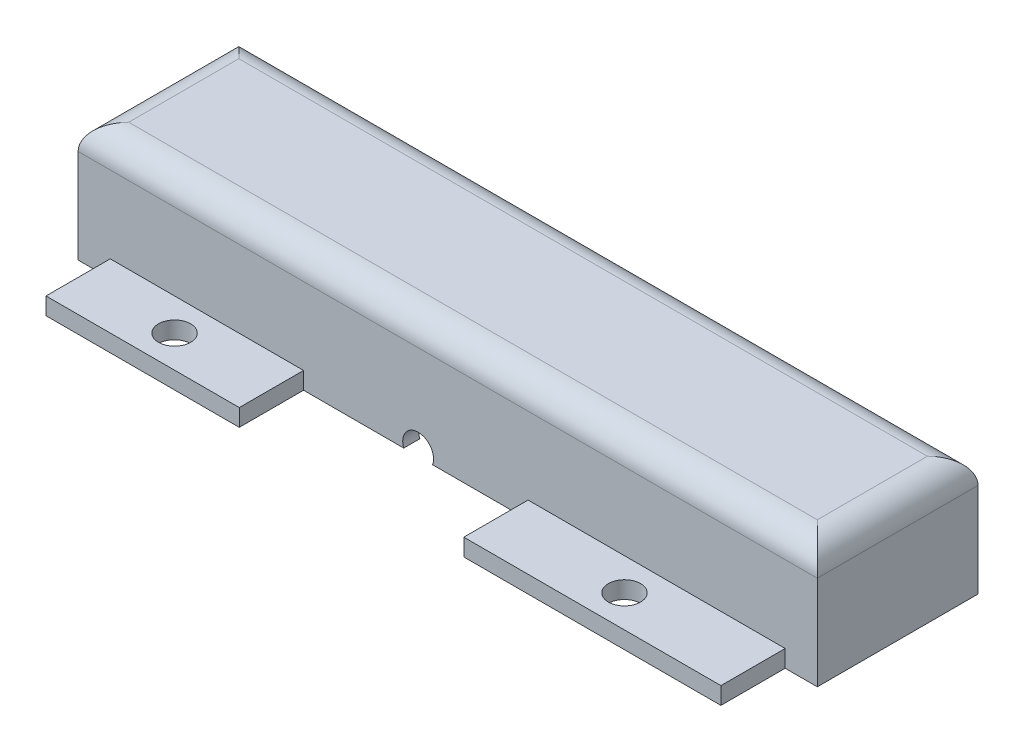
ISO-10303-21;
HEADER;
FILE_DESCRIPTION(('STEP AP214'),'2;1');
FILE_NAME('part.step','',(''),(''),'','','');
FILE_SCHEMA(('AUTOMOTIVE_DESIGN { 1 0 10303 214 1 1 1 1 }'));
ENDSEC;
DATA;
#1=APPLICATION_CONTEXT('core data for automotive mechanical design processes');
#2=APPLICATION_PROTOCOL_DEFINITION('international standard','automotive_design',2000,#1);
#3=PRODUCT_CONTEXT('',#1,'mechanical');
#4=PRODUCT('Part','Part','',(#3));
#5=PRODUCT_RELATED_PRODUCT_CATEGORY('part','',(#4));
#6=PRODUCT_DEFINITION_FORMATION('','',#4);
#7=PRODUCT_DEFINITION_CONTEXT('part definition',#1,'design');
#8=PRODUCT_DEFINITION('design','',#6,#7);
#9=PRODUCT_DEFINITION_SHAPE('','',#8);
#10=(LENGTH_UNIT() NAMED_UNIT(*) SI_UNIT(.MILLI.,.METRE.));
#11=(NAMED_UNIT(*) PLANE_ANGLE_UNIT() SI_UNIT($,.RADIAN.));
#12=(NAMED_UNIT(*) SI_UNIT($,.STERADIAN.) SOLID_ANGLE_UNIT());
#13=UNCERTAINTY_MEASURE_WITH_UNIT(LENGTH_MEASURE(1.E-05),#10,'distance_accuracy_value','');
#14=(GEOMETRIC_REPRESENTATION_CONTEXT(3) GLOBAL_UNCERTAINTY_ASSIGNED_CONTEXT((#13)) GLOBAL_UNIT_ASSIGNED_CONTEXT((#10,
#11,#12)) REPRESENTATION_CONTEXT('',''));
#15=CARTESIAN_POINT('',(0.,0.,0.));
#16=DIRECTION('',(0.,0.,1.));
#17=DIRECTION('',(1.,0.,0.));
#18=AXIS2_PLACEMENT_3D('',#15,#16,#17);
#19=CARTESIAN_POINT('',(0.,0.,0.));
#20=DIRECTION('',(0.,0.,-1.));
#21=DIRECTION('',(-1.,0.,0.));
#22=AXIS2_PLACEMENT_3D('',#19,#20,#21);
#23=PLANE('',#22);
#24=DIRECTION('',(1.,0.,0.));
#25=VECTOR('',#24,1.);
#26=CARTESIAN_POINT('',(-47.6209345794393,0.,0.));
#27=LINE('',#26,#25);
#28=CARTESIAN_POINT('',(38.4290654205607,0.,0.));
#29=VERTEX_POINT('',#28);
#30=CARTESIAN_POINT('',(98.4290654205607,0.,0.));
#31=VERTEX_POINT('',#30);
#32=EDGE_CURVE('E339',#29,#31,#27,.T.);
#33=ORIENTED_EDGE('',*,*,#32,.F.);
#34=DIRECTION('',(0.,-1.,0.));
#35=VECTOR('',#34,1.);
#36=CARTESIAN_POINT('',(38.4290654205607,3.39,0.));
#37=LINE('',#36,#35);
#38=CARTESIAN_POINT('',(38.4290654205607,3.39,0.));
#39=VERTEX_POINT('',#38);
#40=EDGE_CURVE('E217',#39,#29,#37,.T.);
#41=ORIENTED_EDGE('',*,*,#40,.F.);
#42=DIRECTION('',(1.,0.,0.));
#43=VECTOR('',#42,1.);
#44=CARTESIAN_POINT('',(38.4290654205607,3.39,0.));
#45=LINE('',#44,#43);
#46=CARTESIAN_POINT('',(13.0290654205607,3.39,0.));
#47=VERTEX_POINT('',#46);
#48=EDGE_CURVE('E213',#47,#39,#45,.T.);
#49=ORIENTED_EDGE('',*,*,#48,.F.);
#50=DIRECTION('',(0.,1.,0.));
#51=VECTOR('',#50,1.);
#52=CARTESIAN_POINT('',(13.0290654205607,3.39,0.));
#53=LINE('',#52,#51);
#54=CARTESIAN_POINT('',(13.0290654205607,0.,0.));
#55=VERTEX_POINT('',#54);
#56=EDGE_CURVE('E393',#55,#47,#53,.T.);
#57=ORIENTED_EDGE('',*,*,#56,.F.);
#58=CARTESIAN_POINT('',(-47.6209345794393,0.,0.));
#59=VERTEX_POINT('',#58);
#60=EDGE_CURVE('E340',#59,#55,#27,.T.);
#61=ORIENTED_EDGE('',*,*,#60,.F.);
#62=DIRECTION('',(0.,-1.,0.));
#63=VECTOR('',#62,1.);
#64=CARTESIAN_POINT('',(-47.6209345794393,0.,0.));
#65=LINE('',#64,#63);
#66=CARTESIAN_POINT('',(-47.6209345794393,18.59,0.));
#67=VERTEX_POINT('',#66);
#68=EDGE_CURVE('E318',#67,#59,#65,.T.);
#69=ORIENTED_EDGE('',*,*,#68,.F.);
#70=DIRECTION('',(-1.,0.,0.));
#71=VECTOR('',#70,1.);
#72=CARTESIAN_POINT('',(98.4290654205607,18.59,0.));
#73=LINE('',#72,#71);
#74=CARTESIAN_POINT('',(98.4290654205607,18.59,0.));
#75=VERTEX_POINT('',#74);
#76=EDGE_CURVE('E40',#67,#75,#73,.F.);
#77=ORIENTED_EDGE('',*,*,#76,.T.);
#78=DIRECTION('',(0.,1.,0.));
#79=VECTOR('',#78,1.);
#80=CARTESIAN_POINT('',(98.4290654205607,0.,0.));
#81=LINE('',#80,#79);
#82=EDGE_CURVE('E329',#31,#75,#81,.T.);
#83=ORIENTED_EDGE('',*,*,#82,.F.);
#84=EDGE_LOOP('',(#33,#41,#49,#57,#61,#69,#77,#83));
#85=FACE_BOUND('',#84,.T.);
#86=ADVANCED_FACE('F32',(#85),#23,.T.);
#87=CARTESIAN_POINT('',(0.,0.,31.75));
#88=DIRECTION('',(0.,0.,-1.));
#89=DIRECTION('',(-1.,0.,0.));
#90=AXIS2_PLACEMENT_3D('',#87,#88,#89);
#91=PLANE('',#90);
#92=DIRECTION('',(0.,-1.,0.));
#93=VECTOR('',#92,1.);
#94=CARTESIAN_POINT('',(41.2790654205607,0.,31.75));
#95=LINE('',#94,#93);
#96=CARTESIAN_POINT('',(41.2790654205607,3.39,31.75));
#97=VERTEX_POINT('',#96);
#98=CARTESIAN_POINT('',(41.2790654205607,0.,31.75));
#99=VERTEX_POINT('',#98);
#100=EDGE_CURVE('E55',#97,#99,#95,.T.);
#101=ORIENTED_EDGE('',*,*,#100,.F.);
#102=DIRECTION('',(-1.,0.,0.));
#103=VECTOR('',#102,1.);
#104=CARTESIAN_POINT('',(41.2790654205607,3.39,31.75));
#105=LINE('',#104,#103);
#106=CARTESIAN_POINT('',(92.0790654205607,3.39,31.75));
#107=VERTEX_POINT('',#106);
#108=EDGE_CURVE('E229',#107,#97,#105,.T.);
#109=ORIENTED_EDGE('',*,*,#108,.F.);
#110=DIRECTION('',(0.,1.,0.));
#111=VECTOR('',#110,1.);
#112=CARTESIAN_POINT('',(92.0790654205607,0.,31.75));
#113=LINE('',#112,#111);
#114=CARTESIAN_POINT('',(92.0790654205607,0.,31.75));
#115=VERTEX_POINT('',#114);
#116=EDGE_CURVE('E220',#115,#107,#113,.T.);
#117=ORIENTED_EDGE('',*,*,#116,.F.);
#118=DIRECTION('',(1.,0.,0.));
#119=VECTOR('',#118,1.);
#120=CARTESIAN_POINT('',(-47.6209345794393,0.,31.75));
#121=LINE('',#120,#119);
#122=CARTESIAN_POINT('',(98.4290654205607,0.,31.75));
#123=VERTEX_POINT('',#122);
#124=EDGE_CURVE('E328',#115,#123,#121,.T.);
#125=ORIENTED_EDGE('',*,*,#124,.T.);
#126=DIRECTION('',(0.,1.,0.));
#127=VECTOR('',#126,1.);
#128=CARTESIAN_POINT('',(98.4290654205607,0.,31.75));
#129=LINE('',#128,#127);
#130=CARTESIAN_POINT('',(98.4290654205607,18.59,31.75));
#131=VERTEX_POINT('',#130);
#132=EDGE_CURVE('E332',#123,#131,#129,.T.);
#133=ORIENTED_EDGE('',*,*,#132,.T.);
#134=DIRECTION('',(-1.,0.,0.));
#135=VECTOR('',#134,1.);
#136=CARTESIAN_POINT('',(0.,18.59,31.75));
#137=LINE('',#136,#135);
#138=CARTESIAN_POINT('',(-47.6209345794393,18.59,31.75));
#139=VERTEX_POINT('',#138);
#140=EDGE_CURVE('E361',#131,#139,#137,.T.);
#141=ORIENTED_EDGE('',*,*,#140,.T.);
#142=DIRECTION('',(0.,-1.,0.));
#143=VECTOR('',#142,1.);
#144=CARTESIAN_POINT('',(-47.6209345794393,0.,31.75));
#145=LINE('',#144,#143);
#146=CARTESIAN_POINT('',(-47.6209345794393,0.,31.75));
#147=VERTEX_POINT('',#146);
#148=EDGE_CURVE('E326',#139,#147,#145,.T.);
#149=ORIENTED_EDGE('',*,*,#148,.T.);
#150=CARTESIAN_POINT('',(-41.2709345794393,0.,31.75));
#151=VERTEX_POINT('',#150);
#152=EDGE_CURVE('E330',#147,#151,#121,.T.);
#153=ORIENTED_EDGE('',*,*,#152,.T.);
#154=DIRECTION('',(0.,-1.,0.));
#155=VECTOR('',#154,1.);
#156=CARTESIAN_POINT('',(-41.2709345794393,0.,31.75));
#157=LINE('',#156,#155);
#158=CARTESIAN_POINT('',(-41.2709345794393,3.39,31.75));
#159=VERTEX_POINT('',#158);
#160=EDGE_CURVE('E250',#159,#151,#157,.T.);
#161=ORIENTED_EDGE('',*,*,#160,.F.);
#162=DIRECTION('',(-1.,0.,0.));
#163=VECTOR('',#162,1.);
#164=CARTESIAN_POINT('',(-41.2709345794393,3.39,31.75));
#165=LINE('',#164,#163);
#166=CARTESIAN_POINT('',(-3.08093457943929,3.39,31.75));
#167=VERTEX_POINT('',#166);
#168=EDGE_CURVE('E255',#167,#159,#165,.T.);
#169=ORIENTED_EDGE('',*,*,#168,.F.);
#170=DIRECTION('',(0.,1.,0.));
#171=VECTOR('',#170,1.);
#172=CARTESIAN_POINT('',(-3.08093457943929,0.,31.75));
#173=LINE('',#172,#171);
#174=CARTESIAN_POINT('',(-3.08093457943929,0.,31.75));
#175=VERTEX_POINT('',#174);
#176=EDGE_CURVE('E264',#175,#167,#173,.T.);
#177=ORIENTED_EDGE('',*,*,#176,.F.);
#178=CARTESIAN_POINT('',(16.7104868276481,0.,31.75));
#179=VERTEX_POINT('',#178);
#180=EDGE_CURVE('E333',#175,#179,#121,.T.);
#181=ORIENTED_EDGE('',*,*,#180,.T.);
#182=CARTESIAN_POINT('',(19.5590654205607,1.09,31.75));
#183=DIRECTION('',(0.,0.,1.));
#184=DIRECTION('',(1.,0.,0.));
#185=AXIS2_PLACEMENT_3D('',#182,#183,#184);
#186=CIRCLE('',#185,3.05);
#187=CARTESIAN_POINT('',(22.4076440134733,0.,31.75));
#188=VERTEX_POINT('',#187);
#189=EDGE_CURVE('E280',#188,#179,#186,.T.);
#190=ORIENTED_EDGE('',*,*,#189,.F.);
#191=EDGE_CURVE('E334',#188,#99,#121,.T.);
#192=ORIENTED_EDGE('',*,*,#191,.T.);
#193=EDGE_LOOP('',(#101,#109,#117,#125,#133,#141,#149,#153,#161,#169,#177,#181,#190,#192));
#194=FACE_BOUND('',#193,.T.);
#195=ADVANCED_FACE('F396',(#194),#91,.F.);
#196=CARTESIAN_POINT('',(-47.6209345794393,0.,31.75));
#197=DIRECTION('',(1.,0.,0.));
#198=DIRECTION('',(0.,0.,-1.));
#199=AXIS2_PLACEMENT_3D('',#196,#197,#198);
#200=PLANE('',#199);
#201=ORIENTED_EDGE('',*,*,#148,.F.);
#202=DIRECTION('',(0.,0.,-1.));
#203=VECTOR('',#202,1.);
#204=CARTESIAN_POINT('',(-47.6209345794393,18.59,31.75));
#205=LINE('',#204,#203);
#206=EDGE_CURVE('E363',#139,#67,#205,.T.);
#207=ORIENTED_EDGE('',*,*,#206,.T.);
#208=ORIENTED_EDGE('',*,*,#68,.T.);
#209=DIRECTION('',(0.,0.,-1.));
#210=VECTOR('',#209,1.);
#211=CARTESIAN_POINT('',(-47.6209345794393,0.,31.75));
#212=LINE('',#211,#210);
#213=EDGE_CURVE('E346',#147,#59,#212,.T.);
#214=ORIENTED_EDGE('',*,*,#213,.F.);
#215=EDGE_LOOP('',(#201,#207,#208,#214));
#216=FACE_BOUND('',#215,.T.);
#217=ADVANCED_FACE('F386',(#216),#200,.F.);
#218=CARTESIAN_POINT('',(-47.6209345794393,0.,31.75));
#219=DIRECTION('',(0.,1.,0.));
#220=DIRECTION('',(0.,0.,1.));
#221=AXIS2_PLACEMENT_3D('',#218,#219,#220);
#222=PLANE('',#221);
#223=CARTESIAN_POINT('',(25.7290654205607,0.,-6.35));
#224=DIRECTION('',(0.,1.,0.));
#225=DIRECTION('',(0.,0.,1.));
#226=AXIS2_PLACEMENT_3D('',#223,#224,#225);
#227=CIRCLE('',#226,3.175);
#228=CARTESIAN_POINT('',(25.7290654205607,0.,-3.175));
#229=VERTEX_POINT('',#228);
#230=EDGE_CURVE('E512',#229,#229,#227,.T.);
#231=ORIENTED_EDGE('',*,*,#230,.T.);
#232=EDGE_LOOP('',(#231));
#233=FACE_BOUND('',#232,.T.);
#234=CARTESIAN_POINT('',(-22.2209345794393,0.,38.1));
#235=DIRECTION('',(0.,1.,0.));
#236=DIRECTION('',(0.,0.,1.));
#237=AXIS2_PLACEMENT_3D('',#234,#235,#236);
#238=CIRCLE('',#237,3.175);
#239=CARTESIAN_POINT('',(-22.2209345794393,0.,41.275));
#240=VERTEX_POINT('',#239);
#241=EDGE_CURVE('E526',#240,#240,#238,.T.);
#242=ORIENTED_EDGE('',*,*,#241,.T.);
#243=EDGE_LOOP('',(#242));
#244=FACE_BOUND('',#243,.T.);
#245=CARTESIAN_POINT('',(66.6790654205607,0.,38.1));
#246=DIRECTION('',(0.,1.,0.));
#247=DIRECTION('',(0.,0.,1.));
#248=AXIS2_PLACEMENT_3D('',#245,#246,#247);
#249=CIRCLE('',#248,3.175);
#250=CARTESIAN_POINT('',(66.6790654205607,0.,41.275));
#251=VERTEX_POINT('',#250);
#252=EDGE_CURVE('E522',#251,#251,#249,.T.);
#253=ORIENTED_EDGE('',*,*,#252,.T.);
#254=EDGE_LOOP('',(#253));
#255=FACE_BOUND('',#254,.T.);
#256=DIRECTION('',(-1.,0.,0.));
#257=VECTOR('',#256,1.);
#258=CARTESIAN_POINT('',(95.2490654205607,0.,28.57));
#259=LINE('',#258,#257);
#260=CARTESIAN_POINT('',(16.7104868276481,0.,28.57));
#261=VERTEX_POINT('',#260);
#262=CARTESIAN_POINT('',(-44.4409345794393,0.,28.57));
#263=VERTEX_POINT('',#262);
#264=EDGE_CURVE('E310',#261,#263,#259,.T.);
#265=ORIENTED_EDGE('',*,*,#264,.F.);
#266=DIRECTION('',(0.,0.,1.));
#267=VECTOR('',#266,1.);
#268=CARTESIAN_POINT('',(16.7104868276481,0.,28.57));
#269=LINE('',#268,#267);
#270=EDGE_CURVE('E286',#261,#179,#269,.T.);
#271=ORIENTED_EDGE('',*,*,#270,.T.);
#272=ORIENTED_EDGE('',*,*,#180,.F.);
#273=DIRECTION('',(0.,0.,-1.));
#274=VECTOR('',#273,1.);
#275=CARTESIAN_POINT('',(-3.08093457943929,0.,44.45));
#276=LINE('',#275,#274);
#277=CARTESIAN_POINT('',(-3.08093457943929,0.,44.45));
#278=VERTEX_POINT('',#277);
#279=EDGE_CURVE('E274',#278,#175,#276,.T.);
#280=ORIENTED_EDGE('',*,*,#279,.F.);
#281=DIRECTION('',(1.,0.,0.));
#282=VECTOR('',#281,1.);
#283=CARTESIAN_POINT('',(-41.2709345794393,0.,44.45));
#284=LINE('',#283,#282);
#285=CARTESIAN_POINT('',(-41.2709345794393,0.,44.45));
#286=VERTEX_POINT('',#285);
#287=EDGE_CURVE('E254',#286,#278,#284,.T.);
#288=ORIENTED_EDGE('',*,*,#287,.F.);
#289=DIRECTION('',(0.,0.,-1.));
#290=VECTOR('',#289,1.);
#291=CARTESIAN_POINT('',(-41.2709345794393,0.,44.45));
#292=LINE('',#291,#290);
#293=EDGE_CURVE('E277',#286,#151,#292,.T.);
#294=ORIENTED_EDGE('',*,*,#293,.T.);
#295=ORIENTED_EDGE('',*,*,#152,.F.);
#296=ORIENTED_EDGE('',*,*,#213,.T.);
#297=ORIENTED_EDGE('',*,*,#60,.T.);
#298=DIRECTION('',(0.,0.,1.));
#299=VECTOR('',#298,1.);
#300=CARTESIAN_POINT('',(13.0290654205607,0.,-12.7));
#301=LINE('',#300,#299);
#302=CARTESIAN_POINT('',(13.0290654205607,0.,-12.7));
#303=VERTEX_POINT('',#302);
#304=EDGE_CURVE('E201',#303,#55,#301,.T.);
#305=ORIENTED_EDGE('',*,*,#304,.F.);
#306=DIRECTION('',(-1.,0.,0.));
#307=VECTOR('',#306,1.);
#308=CARTESIAN_POINT('',(38.4290654205607,0.,-12.7));
#309=LINE('',#308,#307);
#310=CARTESIAN_POINT('',(38.4290654205607,0.,-12.7));
#311=VERTEX_POINT('',#310);
#312=EDGE_CURVE('E193',#311,#303,#309,.T.);
#313=ORIENTED_EDGE('',*,*,#312,.F.);
#314=DIRECTION('',(0.,0.,1.));
#315=VECTOR('',#314,1.);
#316=CARTESIAN_POINT('',(38.4290654205607,0.,-12.7));
#317=LINE('',#316,#315);
#318=EDGE_CURVE('E198',#311,#29,#317,.T.);
#319=ORIENTED_EDGE('',*,*,#318,.T.);
#320=ORIENTED_EDGE('',*,*,#32,.T.);
#321=DIRECTION('',(0.,0.,-1.));
#322=VECTOR('',#321,1.);
#323=CARTESIAN_POINT('',(98.4290654205607,0.,31.75));
#324=LINE('',#323,#322);
#325=EDGE_CURVE('E337',#123,#31,#324,.T.);
#326=ORIENTED_EDGE('',*,*,#325,.F.);
#327=ORIENTED_EDGE('',*,*,#124,.F.);
#328=DIRECTION('',(0.,0.,-1.));
#329=VECTOR('',#328,1.);
#330=CARTESIAN_POINT('',(92.0790654205607,0.,44.45));
#331=LINE('',#330,#329);
#332=CARTESIAN_POINT('',(92.0790654205607,0.,44.45));
#333=VERTEX_POINT('',#332);
#334=EDGE_CURVE('E244',#333,#115,#331,.T.);
#335=ORIENTED_EDGE('',*,*,#334,.F.);
#336=DIRECTION('',(1.,0.,0.));
#337=VECTOR('',#336,1.);
#338=CARTESIAN_POINT('',(41.2790654205607,0.,44.45));
#339=LINE('',#338,#337);
#340=CARTESIAN_POINT('',(41.2790654205607,0.,44.45));
#341=VERTEX_POINT('',#340);
#342=EDGE_CURVE('E228',#341,#333,#339,.T.);
#343=ORIENTED_EDGE('',*,*,#342,.F.);
#344=DIRECTION('',(0.,0.,-1.));
#345=VECTOR('',#344,1.);
#346=CARTESIAN_POINT('',(41.2790654205607,0.,44.45));
#347=LINE('',#346,#345);
#348=EDGE_CURVE('E247',#341,#99,#347,.T.);
#349=ORIENTED_EDGE('',*,*,#348,.T.);
#350=ORIENTED_EDGE('',*,*,#191,.F.);
#351=DIRECTION('',(0.,0.,1.));
#352=VECTOR('',#351,1.);
#353=CARTESIAN_POINT('',(22.4076440134733,0.,28.57));
#354=LINE('',#353,#352);
#355=CARTESIAN_POINT('',(22.4076440134733,0.,28.57));
#356=VERTEX_POINT('',#355);
#357=EDGE_CURVE('E283',#188,#356,#354,.F.);
#358=ORIENTED_EDGE('',*,*,#357,.T.);
#359=CARTESIAN_POINT('',(95.2490654205607,0.,28.57));
#360=VERTEX_POINT('',#359);
#361=EDGE_CURVE('E311',#360,#356,#259,.T.);
#362=ORIENTED_EDGE('',*,*,#361,.F.);
#363=DIRECTION('',(0.,0.,1.));
#364=VECTOR('',#363,1.);
#365=CARTESIAN_POINT('',(95.2490654205607,0.,3.18));
#366=LINE('',#365,#364);
#367=CARTESIAN_POINT('',(95.2490654205607,0.,3.18));
#368=VERTEX_POINT('',#367);
#369=EDGE_CURVE('E306',#368,#360,#366,.T.);
#370=ORIENTED_EDGE('',*,*,#369,.F.);
#371=DIRECTION('',(1.,0.,0.));
#372=VECTOR('',#371,1.);
#373=CARTESIAN_POINT('',(-44.4409345794393,0.,3.18));
#374=LINE('',#373,#372);
#375=CARTESIAN_POINT('',(-44.4409345794393,0.,3.18));
#376=VERTEX_POINT('',#375);
#377=EDGE_CURVE('E304',#376,#368,#374,.T.);
#378=ORIENTED_EDGE('',*,*,#377,.F.);
#379=DIRECTION('',(0.,0.,-1.));
#380=VECTOR('',#379,1.);
#381=CARTESIAN_POINT('',(-44.4409345794393,0.,28.57));
#382=LINE('',#381,#380);
#383=EDGE_CURVE('E294',#263,#376,#382,.T.);
#384=ORIENTED_EDGE('',*,*,#383,.F.);
#385=EDGE_LOOP('',(#265,#271,#272,#280,#288,#294,#295,#296,#297,#305,#313,#319,#320,#326,#327,
#335,#343,#349,#350,#358,#362,#370,#378,#384));
#386=FACE_BOUND('',#385,.T.);
#387=ADVANCED_FACE('F196',(#233,#244,#255,#386),#222,.F.);
#388=CARTESIAN_POINT('',(98.4290654205607,0.,31.75));
#389=DIRECTION('',(-1.,0.,0.));
#390=DIRECTION('',(0.,0.,1.));
#391=AXIS2_PLACEMENT_3D('',#388,#389,#390);
#392=PLANE('',#391);
#393=ORIENTED_EDGE('',*,*,#82,.T.);
#394=DIRECTION('',(0.,0.,-1.));
#395=VECTOR('',#394,1.);
#396=CARTESIAN_POINT('',(98.4290654205607,18.59,31.75));
#397=LINE('',#396,#395);
#398=EDGE_CURVE('E358',#75,#131,#397,.F.);
#399=ORIENTED_EDGE('',*,*,#398,.T.);
#400=ORIENTED_EDGE('',*,*,#132,.F.);
#401=ORIENTED_EDGE('',*,*,#325,.T.);
#402=EDGE_LOOP('',(#393,#399,#400,#401));
#403=FACE_BOUND('',#402,.T.);
#404=ADVANCED_FACE('F401',(#403),#392,.F.);
#405=CARTESIAN_POINT('',(-47.6209345794393,23.59,31.75));
#406=DIRECTION('',(0.,-1.,0.));
#407=DIRECTION('',(0.,0.,-1.));
#408=AXIS2_PLACEMENT_3D('',#405,#406,#407);
#409=PLANE('',#408);
#410=DIRECTION('',(-1.,0.,0.));
#411=VECTOR('',#410,1.);
#412=CARTESIAN_POINT('',(-47.6209345794393,23.59,26.75));
#413=LINE('',#412,#411);
#414=CARTESIAN_POINT('',(-42.6209345794393,23.59,26.75));
#415=VERTEX_POINT('',#414);
#416=CARTESIAN_POINT('',(93.4290654205607,23.59,26.75));
#417=VERTEX_POINT('',#416);
#418=EDGE_CURVE('E353',#415,#417,#413,.F.);
#419=ORIENTED_EDGE('',*,*,#418,.T.);
#420=DIRECTION('',(0.,0.,-1.));
#421=VECTOR('',#420,1.);
#422=CARTESIAN_POINT('',(93.4290654205607,23.59,31.75));
#423=LINE('',#422,#421);
#424=CARTESIAN_POINT('',(93.4290654205607,23.59,5.));
#425=VERTEX_POINT('',#424);
#426=EDGE_CURVE('E355',#417,#425,#423,.T.);
#427=ORIENTED_EDGE('',*,*,#426,.T.);
#428=DIRECTION('',(-1.,0.,0.));
#429=VECTOR('',#428,1.);
#430=CARTESIAN_POINT('',(-47.6209345794393,23.59,5.));
#431=LINE('',#430,#429);
#432=CARTESIAN_POINT('',(-42.6209345794393,23.59,5.));
#433=VERTEX_POINT('',#432);
#434=EDGE_CURVE('E349',#425,#433,#431,.T.);
#435=ORIENTED_EDGE('',*,*,#434,.T.);
#436=DIRECTION('',(0.,0.,-1.));
#437=VECTOR('',#436,1.);
#438=CARTESIAN_POINT('',(-42.6209345794393,23.59,31.75));
#439=LINE('',#438,#437);
#440=EDGE_CURVE('E351',#433,#415,#439,.F.);
#441=ORIENTED_EDGE('',*,*,#440,.T.);
#442=EDGE_LOOP('',(#419,#427,#435,#441));
#443=FACE_BOUND('',#442,.T.);
#444=ADVANCED_FACE('F411',(#443),#409,.F.);
#445=CARTESIAN_POINT('',(-44.4409345794393,21.,3.18));
#446=DIRECTION('',(0.,0.,-1.));
#447=DIRECTION('',(-1.,0.,0.));
#448=AXIS2_PLACEMENT_3D('',#445,#446,#447);
#449=PLANE('',#448);
#450=ORIENTED_EDGE('',*,*,#377,.T.);
#451=DIRECTION('',(0.,-1.,0.));
#452=VECTOR('',#451,1.);
#453=CARTESIAN_POINT('',(95.2490654205607,21.,3.18));
#454=LINE('',#453,#452);
#455=CARTESIAN_POINT('',(95.2490654205607,21.,3.18));
#456=VERTEX_POINT('',#455);
#457=EDGE_CURVE('E303',#456,#368,#454,.T.);
#458=ORIENTED_EDGE('',*,*,#457,.F.);
#459=DIRECTION('',(1.,0.,0.));
#460=VECTOR('',#459,1.);
#461=CARTESIAN_POINT('',(-44.4409345794393,21.,3.18));
#462=LINE('',#461,#460);
#463=CARTESIAN_POINT('',(-44.4409345794393,21.,3.18));
#464=VERTEX_POINT('',#463);
#465=EDGE_CURVE('E290',#464,#456,#462,.T.);
#466=ORIENTED_EDGE('',*,*,#465,.F.);
#467=DIRECTION('',(0.,-1.,0.));
#468=VECTOR('',#467,1.);
#469=CARTESIAN_POINT('',(-44.4409345794393,21.,3.18));
#470=LINE('',#469,#468);
#471=EDGE_CURVE('E316',#464,#376,#470,.T.);
#472=ORIENTED_EDGE('',*,*,#471,.T.);
#473=EDGE_LOOP('',(#450,#458,#466,#472));
#474=FACE_BOUND('',#473,.T.);
#475=ADVANCED_FACE('F413',(#474),#449,.F.);
#476=CARTESIAN_POINT('',(-44.4409345794393,21.,28.57));
#477=DIRECTION('',(-1.,0.,0.));
#478=DIRECTION('',(0.,0.,1.));
#479=AXIS2_PLACEMENT_3D('',#476,#477,#478);
#480=PLANE('',#479);
#481=ORIENTED_EDGE('',*,*,#383,.T.);
#482=ORIENTED_EDGE('',*,*,#471,.F.);
#483=DIRECTION('',(0.,0.,-1.));
#484=VECTOR('',#483,1.);
#485=CARTESIAN_POINT('',(-44.4409345794393,21.,28.57));
#486=LINE('',#485,#484);
#487=CARTESIAN_POINT('',(-44.4409345794393,21.,28.57));
#488=VERTEX_POINT('',#487);
#489=EDGE_CURVE('E300',#488,#464,#486,.T.);
#490=ORIENTED_EDGE('',*,*,#489,.F.);
#491=DIRECTION('',(0.,-1.,0.));
#492=VECTOR('',#491,1.);
#493=CARTESIAN_POINT('',(-44.4409345794393,21.,28.57));
#494=LINE('',#493,#492);
#495=EDGE_CURVE('E319',#488,#263,#494,.T.);
#496=ORIENTED_EDGE('',*,*,#495,.T.);
#497=EDGE_LOOP('',(#481,#482,#490,#496));
#498=FACE_BOUND('',#497,.T.);
#499=ADVANCED_FACE('F419',(#498),#480,.F.);
#500=CARTESIAN_POINT('',(95.2490654205607,21.,28.57));
#501=DIRECTION('',(0.,0.,1.));
#502=DIRECTION('',(1.,0.,0.));
#503=AXIS2_PLACEMENT_3D('',#500,#501,#502);
#504=PLANE('',#503);
#505=ORIENTED_EDGE('',*,*,#361,.T.);
#506=CARTESIAN_POINT('',(19.5590654205607,1.09,28.57));
#507=DIRECTION('',(0.,0.,1.));
#508=DIRECTION('',(1.,0.,0.));
#509=AXIS2_PLACEMENT_3D('',#506,#507,#508);
#510=CIRCLE('',#509,3.05);
#511=EDGE_CURVE('E11',#356,#261,#510,.T.);
#512=ORIENTED_EDGE('',*,*,#511,.T.);
#513=ORIENTED_EDGE('',*,*,#264,.T.);
#514=ORIENTED_EDGE('',*,*,#495,.F.);
#515=DIRECTION('',(-1.,0.,0.));
#516=VECTOR('',#515,1.);
#517=CARTESIAN_POINT('',(95.2490654205607,21.,28.57));
#518=LINE('',#517,#516);
#519=CARTESIAN_POINT('',(95.2490654205607,21.,28.57));
#520=VERTEX_POINT('',#519);
#521=EDGE_CURVE('E297',#520,#488,#518,.T.);
#522=ORIENTED_EDGE('',*,*,#521,.F.);
#523=DIRECTION('',(0.,-1.,0.));
#524=VECTOR('',#523,1.);
#525=CARTESIAN_POINT('',(95.2490654205607,21.,28.57));
#526=LINE('',#525,#524);
#527=EDGE_CURVE('E322',#520,#360,#526,.T.);
#528=ORIENTED_EDGE('',*,*,#527,.T.);
#529=EDGE_LOOP('',(#505,#512,#513,#514,#522,#528));
#530=FACE_BOUND('',#529,.T.);
#531=ADVANCED_FACE('F434',(#530),#504,.F.);
#532=CARTESIAN_POINT('',(95.2490654205607,21.,3.18));
#533=DIRECTION('',(1.,0.,0.));
#534=DIRECTION('',(0.,0.,-1.));
#535=AXIS2_PLACEMENT_3D('',#532,#533,#534);
#536=PLANE('',#535);
#537=ORIENTED_EDGE('',*,*,#369,.T.);
#538=ORIENTED_EDGE('',*,*,#527,.F.);
#539=DIRECTION('',(0.,0.,1.));
#540=VECTOR('',#539,1.);
#541=CARTESIAN_POINT('',(95.2490654205607,21.,3.18));
#542=LINE('',#541,#540);
#543=EDGE_CURVE('E293',#456,#520,#542,.T.);
#544=ORIENTED_EDGE('',*,*,#543,.F.);
#545=ORIENTED_EDGE('',*,*,#457,.T.);
#546=EDGE_LOOP('',(#537,#538,#544,#545));
#547=FACE_BOUND('',#546,.T.);
#548=ADVANCED_FACE('F430',(#547),#536,.F.);
#549=CARTESIAN_POINT('',(0.,21.,0.));
#550=DIRECTION('',(0.,-1.,0.));
#551=DIRECTION('',(0.,0.,-1.));
#552=AXIS2_PLACEMENT_3D('',#549,#550,#551);
#553=PLANE('',#552);
#554=ORIENTED_EDGE('',*,*,#465,.T.);
#555=ORIENTED_EDGE('',*,*,#543,.T.);
#556=ORIENTED_EDGE('',*,*,#521,.T.);
#557=ORIENTED_EDGE('',*,*,#489,.T.);
#558=EDGE_LOOP('',(#554,#555,#556,#557));
#559=FACE_BOUND('',#558,.T.);
#560=ADVANCED_FACE('F433',(#559),#553,.T.);
#561=CARTESIAN_POINT('',(-42.6209345794393,18.59,31.75));
#562=DIRECTION('',(0.,0.,-1.));
#563=DIRECTION('',(-1.,0.,0.));
#564=AXIS2_PLACEMENT_3D('',#561,#562,#563);
#565=CYLINDRICAL_SURFACE('',#564,5.);
#566=CARTESIAN_POINT('',(-42.6209345794393,18.59,5.));
#567=DIRECTION('',(0.707106781186547,0.,-0.707106781186547));
#568=DIRECTION('',(0.707106781186547,0.,0.707106781186547));
#569=AXIS2_PLACEMENT_3D('',#566,#567,#568);
#570=ELLIPSE('',#569,7.07106781186547,5.);
#571=EDGE_CURVE('E369',#67,#433,#570,.T.);
#572=ORIENTED_EDGE('',*,*,#571,.F.);
#573=ORIENTED_EDGE('',*,*,#206,.F.);
#574=CARTESIAN_POINT('',(-42.6209345794393,18.59,26.75));
#575=DIRECTION('',(-0.707106781186547,0.,-0.707106781186547));
#576=DIRECTION('',(0.707106781186547,0.,-0.707106781186547));
#577=AXIS2_PLACEMENT_3D('',#574,#575,#576);
#578=ELLIPSE('',#577,7.07106781186547,5.);
#579=EDGE_CURVE('E307',#415,#139,#578,.F.);
#580=ORIENTED_EDGE('',*,*,#579,.F.);
#581=ORIENTED_EDGE('',*,*,#440,.F.);
#582=EDGE_LOOP('',(#572,#573,#580,#581));
#583=FACE_BOUND('',#582,.T.);
#584=ADVANCED_FACE('F34',(#583),#565,.T.);
#585=CARTESIAN_POINT('',(0.,18.59,26.75));
#586=DIRECTION('',(-1.,0.,0.));
#587=DIRECTION('',(0.,0.,1.));
#588=AXIS2_PLACEMENT_3D('',#585,#586,#587);
#589=CYLINDRICAL_SURFACE('',#588,5.);
#590=ORIENTED_EDGE('',*,*,#579,.T.);
#591=ORIENTED_EDGE('',*,*,#140,.F.);
#592=CARTESIAN_POINT('',(93.4290654205607,18.59,26.75));
#593=DIRECTION('',(-0.707106781186547,0.,0.707106781186547));
#594=DIRECTION('',(-0.707106781186547,0.,-0.707106781186547));
#595=AXIS2_PLACEMENT_3D('',#592,#593,#594);
#596=ELLIPSE('',#595,7.07106781186547,5.);
#597=EDGE_CURVE('E367',#417,#131,#596,.F.);
#598=ORIENTED_EDGE('',*,*,#597,.F.);
#599=ORIENTED_EDGE('',*,*,#418,.F.);
#600=EDGE_LOOP('',(#590,#591,#598,#599));
#601=FACE_BOUND('',#600,.T.);
#602=ADVANCED_FACE('F376',(#601),#589,.T.);
#603=CARTESIAN_POINT('',(-47.6209345794393,18.59,5.));
#604=DIRECTION('',(1.,0.,0.));
#605=DIRECTION('',(0.,0.,-1.));
#606=AXIS2_PLACEMENT_3D('',#603,#604,#605);
#607=CYLINDRICAL_SURFACE('',#606,5.);
#608=ORIENTED_EDGE('',*,*,#571,.T.);
#609=ORIENTED_EDGE('',*,*,#434,.F.);
#610=CARTESIAN_POINT('',(93.4290654205607,18.59,5.));
#611=DIRECTION('',(0.707106781186547,0.,0.707106781186547));
#612=DIRECTION('',(0.707106781186547,0.,-0.707106781186547));
#613=AXIS2_PLACEMENT_3D('',#610,#611,#612);
#614=ELLIPSE('',#613,7.07106781186547,5.);
#615=EDGE_CURVE('E289',#75,#425,#614,.T.);
#616=ORIENTED_EDGE('',*,*,#615,.F.);
#617=ORIENTED_EDGE('',*,*,#76,.F.);
#618=EDGE_LOOP('',(#608,#609,#616,#617));
#619=FACE_BOUND('',#618,.T.);
#620=ADVANCED_FACE('F409',(#619),#607,.T.);
#621=CARTESIAN_POINT('',(93.4290654205607,18.59,31.75));
#622=DIRECTION('',(0.,0.,-1.));
#623=DIRECTION('',(-1.,0.,0.));
#624=AXIS2_PLACEMENT_3D('',#621,#622,#623);
#625=CYLINDRICAL_SURFACE('',#624,5.);
#626=ORIENTED_EDGE('',*,*,#597,.T.);
#627=ORIENTED_EDGE('',*,*,#398,.F.);
#628=ORIENTED_EDGE('',*,*,#615,.T.);
#629=ORIENTED_EDGE('',*,*,#426,.F.);
#630=EDGE_LOOP('',(#626,#627,#628,#629));
#631=FACE_BOUND('',#630,.T.);
#632=ADVANCED_FACE('F405',(#631),#625,.T.);
#633=CARTESIAN_POINT('',(19.5590654205607,1.09,28.57));
#634=DIRECTION('',(0.,0.,1.));
#635=DIRECTION('',(1.,0.,0.));
#636=AXIS2_PLACEMENT_3D('',#633,#634,#635);
#637=CYLINDRICAL_SURFACE('',#636,3.05);
#638=ORIENTED_EDGE('',*,*,#511,.F.);
#639=ORIENTED_EDGE('',*,*,#357,.F.);
#640=ORIENTED_EDGE('',*,*,#189,.T.);
#641=ORIENTED_EDGE('',*,*,#270,.F.);
#642=EDGE_LOOP('',(#638,#639,#640,#641));
#643=FACE_BOUND('',#642,.T.);
#644=ADVANCED_FACE('F445',(#643),#637,.F.);
#645=CARTESIAN_POINT('',(-41.2709345794393,0.,44.45));
#646=DIRECTION('',(1.,0.,0.));
#647=DIRECTION('',(0.,0.,-1.));
#648=AXIS2_PLACEMENT_3D('',#645,#646,#647);
#649=PLANE('',#648);
#650=ORIENTED_EDGE('',*,*,#160,.T.);
#651=ORIENTED_EDGE('',*,*,#293,.F.);
#652=DIRECTION('',(0.,-1.,0.));
#653=VECTOR('',#652,1.);
#654=CARTESIAN_POINT('',(-41.2709345794393,0.,44.45));
#655=LINE('',#654,#653);
#656=CARTESIAN_POINT('',(-41.2709345794393,3.39,44.45));
#657=VERTEX_POINT('',#656);
#658=EDGE_CURVE('E251',#657,#286,#655,.T.);
#659=ORIENTED_EDGE('',*,*,#658,.F.);
#660=DIRECTION('',(0.,0.,-1.));
#661=VECTOR('',#660,1.);
#662=CARTESIAN_POINT('',(-41.2709345794393,3.39,44.45));
#663=LINE('',#662,#661);
#664=EDGE_CURVE('E261',#657,#159,#663,.T.);
#665=ORIENTED_EDGE('',*,*,#664,.T.);
#666=EDGE_LOOP('',(#650,#651,#659,#665));
#667=FACE_BOUND('',#666,.T.);
#668=ADVANCED_FACE('F448',(#667),#649,.F.);
#669=CARTESIAN_POINT('',(-3.08093457943929,0.,44.45));
#670=DIRECTION('',(-1.,0.,0.));
#671=DIRECTION('',(0.,0.,1.));
#672=AXIS2_PLACEMENT_3D('',#669,#670,#671);
#673=PLANE('',#672);
#674=ORIENTED_EDGE('',*,*,#176,.T.);
#675=DIRECTION('',(0.,0.,-1.));
#676=VECTOR('',#675,1.);
#677=CARTESIAN_POINT('',(-3.08093457943929,3.39,44.45));
#678=LINE('',#677,#676);
#679=CARTESIAN_POINT('',(-3.08093457943929,3.39,44.45));
#680=VERTEX_POINT('',#679);
#681=EDGE_CURVE('E271',#680,#167,#678,.T.);
#682=ORIENTED_EDGE('',*,*,#681,.F.);
#683=DIRECTION('',(0.,1.,0.));
#684=VECTOR('',#683,1.);
#685=CARTESIAN_POINT('',(-3.08093457943929,0.,44.45));
#686=LINE('',#685,#684);
#687=EDGE_CURVE('E257',#278,#680,#686,.T.);
#688=ORIENTED_EDGE('',*,*,#687,.F.);
#689=ORIENTED_EDGE('',*,*,#279,.T.);
#690=EDGE_LOOP('',(#674,#682,#688,#689));
#691=FACE_BOUND('',#690,.T.);
#692=ADVANCED_FACE('F452',(#691),#673,.F.);
#693=CARTESIAN_POINT('',(-41.2709345794393,3.39,44.45));
#694=DIRECTION('',(0.,-1.,0.));
#695=DIRECTION('',(0.,0.,-1.));
#696=AXIS2_PLACEMENT_3D('',#693,#694,#695);
#697=PLANE('',#696);
#698=CARTESIAN_POINT('',(-22.2209345794393,3.39,38.1));
#699=DIRECTION('',(0.,1.,0.));
#700=DIRECTION('',(0.,0.,1.));
#701=AXIS2_PLACEMENT_3D('',#698,#699,#700);
#702=CIRCLE('',#701,3.175);
#703=CARTESIAN_POINT('',(-22.2209345794393,3.39,41.275));
#704=VERTEX_POINT('',#703);
#705=EDGE_CURVE('E517',#704,#704,#702,.T.);
#706=ORIENTED_EDGE('',*,*,#705,.F.);
#707=EDGE_LOOP('',(#706));
#708=FACE_BOUND('',#707,.T.);
#709=ORIENTED_EDGE('',*,*,#168,.T.);
#710=ORIENTED_EDGE('',*,*,#664,.F.);
#711=DIRECTION('',(-1.,0.,0.));
#712=VECTOR('',#711,1.);
#713=CARTESIAN_POINT('',(-41.2709345794393,3.39,44.45));
#714=LINE('',#713,#712);
#715=EDGE_CURVE('E259',#680,#657,#714,.T.);
#716=ORIENTED_EDGE('',*,*,#715,.F.);
#717=ORIENTED_EDGE('',*,*,#681,.T.);
#718=EDGE_LOOP('',(#709,#710,#716,#717));
#719=FACE_BOUND('',#718,.T.);
#720=ADVANCED_FACE('F456',(#708,#719),#697,.F.);
#721=CARTESIAN_POINT('',(0.,0.,44.45));
#722=DIRECTION('',(0.,0.,-1.));
#723=DIRECTION('',(-1.,0.,0.));
#724=AXIS2_PLACEMENT_3D('',#721,#722,#723);
#725=PLANE('',#724);
#726=ORIENTED_EDGE('',*,*,#658,.T.);
#727=ORIENTED_EDGE('',*,*,#287,.T.);
#728=ORIENTED_EDGE('',*,*,#687,.T.);
#729=ORIENTED_EDGE('',*,*,#715,.T.);
#730=EDGE_LOOP('',(#726,#727,#728,#729));
#731=FACE_BOUND('',#730,.T.);
#732=ADVANCED_FACE('F460',(#731),#725,.F.);
#733=CARTESIAN_POINT('',(41.2790654205607,0.,44.45));
#734=DIRECTION('',(1.,0.,0.));
#735=DIRECTION('',(0.,0.,-1.));
#736=AXIS2_PLACEMENT_3D('',#733,#734,#735);
#737=PLANE('',#736);
#738=ORIENTED_EDGE('',*,*,#100,.T.);
#739=ORIENTED_EDGE('',*,*,#348,.F.);
#740=DIRECTION('',(0.,-1.,0.));
#741=VECTOR('',#740,1.);
#742=CARTESIAN_POINT('',(41.2790654205607,0.,44.45));
#743=LINE('',#742,#741);
#744=CARTESIAN_POINT('',(41.2790654205607,3.39,44.45));
#745=VERTEX_POINT('',#744);
#746=EDGE_CURVE('E225',#745,#341,#743,.T.);
#747=ORIENTED_EDGE('',*,*,#746,.F.);
#748=DIRECTION('',(0.,0.,-1.));
#749=VECTOR('',#748,1.);
#750=CARTESIAN_POINT('',(41.2790654205607,3.39,44.45));
#751=LINE('',#750,#749);
#752=EDGE_CURVE('E234',#745,#97,#751,.T.);
#753=ORIENTED_EDGE('',*,*,#752,.T.);
#754=EDGE_LOOP('',(#738,#739,#747,#753));
#755=FACE_BOUND('',#754,.T.);
#756=ADVANCED_FACE('F464',(#755),#737,.F.);
#757=CARTESIAN_POINT('',(92.0790654205607,0.,44.45));
#758=DIRECTION('',(-1.,0.,0.));
#759=DIRECTION('',(0.,0.,1.));
#760=AXIS2_PLACEMENT_3D('',#757,#758,#759);
#761=PLANE('',#760);
#762=ORIENTED_EDGE('',*,*,#116,.T.);
#763=DIRECTION('',(0.,0.,-1.));
#764=VECTOR('',#763,1.);
#765=CARTESIAN_POINT('',(92.0790654205607,3.39,44.45));
#766=LINE('',#765,#764);
#767=CARTESIAN_POINT('',(92.0790654205607,3.39,44.45));
#768=VERTEX_POINT('',#767);
#769=EDGE_CURVE('E241',#768,#107,#766,.T.);
#770=ORIENTED_EDGE('',*,*,#769,.F.);
#771=DIRECTION('',(0.,1.,0.));
#772=VECTOR('',#771,1.);
#773=CARTESIAN_POINT('',(92.0790654205607,0.,44.45));
#774=LINE('',#773,#772);
#775=EDGE_CURVE('E231',#333,#768,#774,.T.);
#776=ORIENTED_EDGE('',*,*,#775,.F.);
#777=ORIENTED_EDGE('',*,*,#334,.T.);
#778=EDGE_LOOP('',(#762,#770,#776,#777));
#779=FACE_BOUND('',#778,.T.);
#780=ADVANCED_FACE('F468',(#779),#761,.F.);
#781=CARTESIAN_POINT('',(41.2790654205607,3.39,44.45));
#782=DIRECTION('',(0.,-1.,0.));
#783=DIRECTION('',(0.,0.,-1.));
#784=AXIS2_PLACEMENT_3D('',#781,#782,#783);
#785=PLANE('',#784);
#786=CARTESIAN_POINT('',(66.6790654205607,3.39,38.1));
#787=DIRECTION('',(0.,1.,0.));
#788=DIRECTION('',(0.,0.,1.));
#789=AXIS2_PLACEMENT_3D('',#786,#787,#788);
#790=CIRCLE('',#789,3.175);
#791=CARTESIAN_POINT('',(66.6790654205607,3.39,41.275));
#792=VERTEX_POINT('',#791);
#793=EDGE_CURVE('E514',#792,#792,#790,.T.);
#794=ORIENTED_EDGE('',*,*,#793,.F.);
#795=EDGE_LOOP('',(#794));
#796=FACE_BOUND('',#795,.T.);
#797=ORIENTED_EDGE('',*,*,#108,.T.);
#798=ORIENTED_EDGE('',*,*,#752,.F.);
#799=DIRECTION('',(-1.,0.,0.));
#800=VECTOR('',#799,1.);
#801=CARTESIAN_POINT('',(41.2790654205607,3.39,44.45));
#802=LINE('',#801,#800);
#803=EDGE_CURVE('E233',#768,#745,#802,.T.);
#804=ORIENTED_EDGE('',*,*,#803,.F.);
#805=ORIENTED_EDGE('',*,*,#769,.T.);
#806=EDGE_LOOP('',(#797,#798,#804,#805));
#807=FACE_BOUND('',#806,.T.);
#808=ADVANCED_FACE('F472',(#796,#807),#785,.F.);
#809=CARTESIAN_POINT('',(0.,0.,44.45));
#810=DIRECTION('',(0.,0.,-1.));
#811=DIRECTION('',(-1.,0.,0.));
#812=AXIS2_PLACEMENT_3D('',#809,#810,#811);
#813=PLANE('',#812);
#814=ORIENTED_EDGE('',*,*,#746,.T.);
#815=ORIENTED_EDGE('',*,*,#342,.T.);
#816=ORIENTED_EDGE('',*,*,#775,.T.);
#817=ORIENTED_EDGE('',*,*,#803,.T.);
#818=EDGE_LOOP('',(#814,#815,#816,#817));
#819=FACE_BOUND('',#818,.T.);
#820=ADVANCED_FACE('F476',(#819),#813,.F.);
#821=CARTESIAN_POINT('',(38.4290654205607,3.39,-12.7));
#822=DIRECTION('',(-1.,0.,0.));
#823=DIRECTION('',(0.,0.,1.));
#824=AXIS2_PLACEMENT_3D('',#821,#822,#823);
#825=PLANE('',#824);
#826=ORIENTED_EDGE('',*,*,#40,.T.);
#827=ORIENTED_EDGE('',*,*,#318,.F.);
#828=DIRECTION('',(0.,-1.,0.));
#829=VECTOR('',#828,1.);
#830=CARTESIAN_POINT('',(38.4290654205607,3.39,-12.7));
#831=LINE('',#830,#829);
#832=CARTESIAN_POINT('',(38.4290654205607,3.39,-12.7));
#833=VERTEX_POINT('',#832);
#834=EDGE_CURVE('E205',#833,#311,#831,.T.);
#835=ORIENTED_EDGE('',*,*,#834,.F.);
#836=DIRECTION('',(0.,0.,1.));
#837=VECTOR('',#836,1.);
#838=CARTESIAN_POINT('',(38.4290654205607,3.39,-12.7));
#839=LINE('',#838,#837);
#840=EDGE_CURVE('E531',#833,#39,#839,.T.);
#841=ORIENTED_EDGE('',*,*,#840,.T.);
#842=EDGE_LOOP('',(#826,#827,#835,#841));
#843=FACE_BOUND('',#842,.T.);
#844=ADVANCED_FACE('F215',(#843),#825,.F.);
#845=CARTESIAN_POINT('',(13.0290654205607,3.39,-12.7));
#846=DIRECTION('',(1.,0.,0.));
#847=DIRECTION('',(0.,1.,0.));
#848=AXIS2_PLACEMENT_3D('',#845,#846,#847);
#849=PLANE('',#848);
#850=ORIENTED_EDGE('',*,*,#56,.T.);
#851=DIRECTION('',(0.,0.,1.));
#852=VECTOR('',#851,1.);
#853=CARTESIAN_POINT('',(13.0290654205607,3.39,-12.7));
#854=LINE('',#853,#852);
#855=CARTESIAN_POINT('',(13.0290654205607,3.39,-12.7));
#856=VERTEX_POINT('',#855);
#857=EDGE_CURVE('E47',#856,#47,#854,.T.);
#858=ORIENTED_EDGE('',*,*,#857,.F.);
#859=DIRECTION('',(0.,1.,0.));
#860=VECTOR('',#859,1.);
#861=CARTESIAN_POINT('',(13.0290654205607,3.39,-12.7));
#862=LINE('',#861,#860);
#863=EDGE_CURVE('E204',#303,#856,#862,.T.);
#864=ORIENTED_EDGE('',*,*,#863,.F.);
#865=ORIENTED_EDGE('',*,*,#304,.T.);
#866=EDGE_LOOP('',(#850,#858,#864,#865));
#867=FACE_BOUND('',#866,.T.);
#868=ADVANCED_FACE('F483',(#867),#849,.F.);
#869=CARTESIAN_POINT('',(38.4290654205607,3.39,-12.7));
#870=DIRECTION('',(0.,-1.,0.));
#871=DIRECTION('',(1.,0.,0.));
#872=AXIS2_PLACEMENT_3D('',#869,#870,#871);
#873=PLANE('',#872);
#874=CARTESIAN_POINT('',(25.7290654205607,3.39,-6.35));
#875=DIRECTION('',(0.,1.,0.));
#876=DIRECTION('',(-1.,0.,0.));
#877=AXIS2_PLACEMENT_3D('',#874,#875,#876);
#878=CIRCLE('',#877,3.175);
#879=CARTESIAN_POINT('',(22.5540654205607,3.39,-6.35));
#880=VERTEX_POINT('',#879);
#881=EDGE_CURVE('E509',#880,#880,#878,.T.);
#882=ORIENTED_EDGE('',*,*,#881,.F.);
#883=EDGE_LOOP('',(#882));
#884=FACE_BOUND('',#883,.T.);
#885=ORIENTED_EDGE('',*,*,#48,.T.);
#886=ORIENTED_EDGE('',*,*,#840,.F.);
#887=DIRECTION('',(1.,0.,0.));
#888=VECTOR('',#887,1.);
#889=CARTESIAN_POINT('',(38.4290654205607,3.39,-12.7));
#890=LINE('',#889,#888);
#891=EDGE_CURVE('E209',#856,#833,#890,.T.);
#892=ORIENTED_EDGE('',*,*,#891,.F.);
#893=ORIENTED_EDGE('',*,*,#857,.T.);
#894=EDGE_LOOP('',(#885,#886,#892,#893));
#895=FACE_BOUND('',#894,.T.);
#896=ADVANCED_FACE('F486',(#884,#895),#873,.F.);
#897=CARTESIAN_POINT('',(0.,0.,-12.7));
#898=DIRECTION('',(0.,0.,-1.));
#899=DIRECTION('',(-1.,0.,0.));
#900=AXIS2_PLACEMENT_3D('',#897,#898,#899);
#901=PLANE('',#900);
#902=ORIENTED_EDGE('',*,*,#834,.T.);
#903=ORIENTED_EDGE('',*,*,#312,.T.);
#904=ORIENTED_EDGE('',*,*,#863,.T.);
#905=ORIENTED_EDGE('',*,*,#891,.T.);
#906=EDGE_LOOP('',(#902,#903,#904,#905));
#907=FACE_BOUND('',#906,.T.);
#908=ADVANCED_FACE('F208',(#907),#901,.T.);
#909=CARTESIAN_POINT('',(66.6790654205607,-9.31,38.1));
#910=DIRECTION('',(0.,1.,0.));
#911=DIRECTION('',(0.,0.,1.));
#912=AXIS2_PLACEMENT_3D('',#909,#910,#911);
#913=CYLINDRICAL_SURFACE('',#912,3.175);
#914=ORIENTED_EDGE('',*,*,#793,.T.);
#915=EDGE_LOOP('',(#914));
#916=FACE_BOUND('',#915,.T.);
#917=ORIENTED_EDGE('',*,*,#252,.F.);
#918=EDGE_LOOP('',(#917));
#919=FACE_BOUND('',#918,.T.);
#920=ADVANCED_FACE('F493',(#916,#919),#913,.F.);
#921=CARTESIAN_POINT('',(-22.2209345794393,-9.31,38.1));
#922=DIRECTION('',(0.,1.,0.));
#923=DIRECTION('',(0.,0.,1.));
#924=AXIS2_PLACEMENT_3D('',#921,#922,#923);
#925=CYLINDRICAL_SURFACE('',#924,3.175);
#926=ORIENTED_EDGE('',*,*,#705,.T.);
#927=EDGE_LOOP('',(#926));
#928=FACE_BOUND('',#927,.T.);
#929=ORIENTED_EDGE('',*,*,#241,.F.);
#930=EDGE_LOOP('',(#929));
#931=FACE_BOUND('',#930,.T.);
#932=ADVANCED_FACE('F496',(#928,#931),#925,.F.);
#933=CARTESIAN_POINT('',(25.7290654205607,-9.31,-6.35));
#934=DIRECTION('',(0.,1.,0.));
#935=DIRECTION('',(-1.,0.,0.));
#936=AXIS2_PLACEMENT_3D('',#933,#934,#935);
#937=CYLINDRICAL_SURFACE('',#936,3.175);
#938=ORIENTED_EDGE('',*,*,#881,.T.);
#939=EDGE_LOOP('',(#938));
#940=FACE_BOUND('',#939,.T.);
#941=ORIENTED_EDGE('',*,*,#230,.F.);
#942=EDGE_LOOP('',(#941));
#943=FACE_BOUND('',#942,.T.);
#944=ADVANCED_FACE('F500',(#940,#943),#937,.F.);
#945=CLOSED_SHELL('',(#86,#195,#217,#387,#404,#444,#475,#499,#531,#548,#560,#584,#602,#620,#632,
#644,#668,#692,#720,#732,#756,#780,#808,#820,#844,#868,#896,#908,#920,#932,#944));
#946=MANIFOLD_SOLID_BREP('B2',#945);
#947=ADVANCED_BREP_SHAPE_REPRESENTATION('',(#18,#946),#14);
#948=SHAPE_DEFINITION_REPRESENTATION(#9,#947);
ENDSEC;
END-ISO-10303-21;
